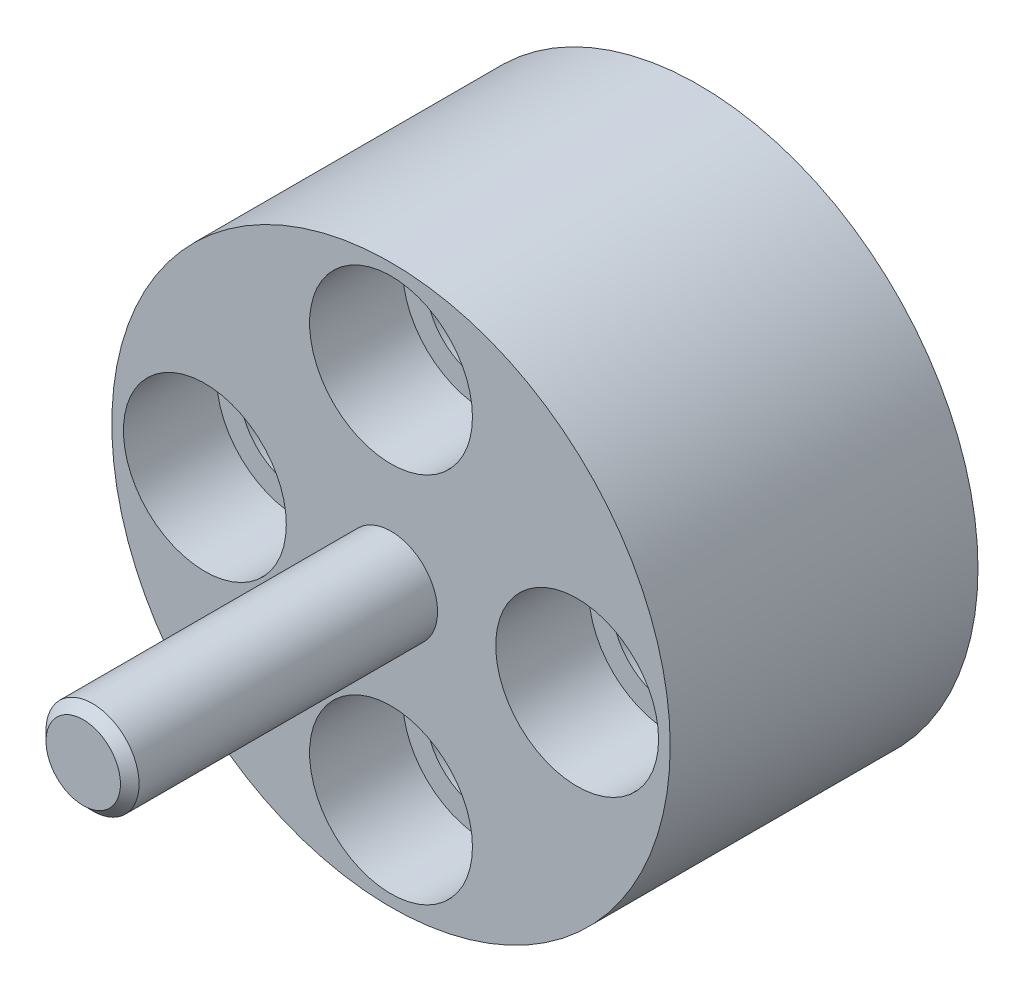
ISO-10303-21;
HEADER;
FILE_DESCRIPTION(('STEP AP214'),'2;1');
FILE_NAME('part.step','',(''),(''),'','','');
FILE_SCHEMA(('AUTOMOTIVE_DESIGN { 1 0 10303 214 1 1 1 1 }'));
ENDSEC;
DATA;
#1=APPLICATION_CONTEXT('core data for automotive mechanical design processes');
#2=APPLICATION_PROTOCOL_DEFINITION('international standard','automotive_design',2000,#1);
#3=PRODUCT_CONTEXT('',#1,'mechanical');
#4=PRODUCT('Part','Part','',(#3));
#5=PRODUCT_RELATED_PRODUCT_CATEGORY('part','',(#4));
#6=PRODUCT_DEFINITION_FORMATION('','',#4);
#7=PRODUCT_DEFINITION_CONTEXT('part definition',#1,'design');
#8=PRODUCT_DEFINITION('design','',#6,#7);
#9=PRODUCT_DEFINITION_SHAPE('','',#8);
#10=(LENGTH_UNIT() NAMED_UNIT(*) SI_UNIT(.MILLI.,.METRE.));
#11=(NAMED_UNIT(*) PLANE_ANGLE_UNIT() SI_UNIT($,.RADIAN.));
#12=(NAMED_UNIT(*) SI_UNIT($,.STERADIAN.) SOLID_ANGLE_UNIT());
#13=UNCERTAINTY_MEASURE_WITH_UNIT(LENGTH_MEASURE(1.E-05),#10,'distance_accuracy_value','');
#14=(GEOMETRIC_REPRESENTATION_CONTEXT(3) GLOBAL_UNCERTAINTY_ASSIGNED_CONTEXT((#13)) GLOBAL_UNIT_ASSIGNED_CONTEXT((#10,
#11,#12)) REPRESENTATION_CONTEXT('',''));
#15=CARTESIAN_POINT('',(0.,0.,0.));
#16=DIRECTION('',(0.,0.,1.));
#17=DIRECTION('',(1.,0.,0.));
#18=AXIS2_PLACEMENT_3D('',#15,#16,#17);
#19=CARTESIAN_POINT('',(0.,0.,0.));
#20=DIRECTION('',(0.,0.,1.));
#21=DIRECTION('',(1.,0.,0.));
#22=AXIS2_PLACEMENT_3D('',#19,#20,#21);
#23=PLANE('',#22);
#24=CARTESIAN_POINT('',(-12.7,0.,0.));
#25=DIRECTION('',(0.,0.,1.));
#26=DIRECTION('',(1.,0.,0.));
#27=AXIS2_PLACEMENT_3D('',#24,#25,#26);
#28=CIRCLE('',#27,3.96875);
#29=CARTESIAN_POINT('',(-8.73125,0.,0.));
#30=VERTEX_POINT('',#29);
#31=EDGE_CURVE('E86',#30,#30,#28,.T.);
#32=ORIENTED_EDGE('',*,*,#31,.T.);
#33=EDGE_LOOP('',(#32));
#34=FACE_BOUND('',#33,.T.);
#35=CARTESIAN_POINT('',(12.7,0.,0.));
#36=DIRECTION('',(0.,0.,1.));
#37=DIRECTION('',(1.,0.,0.));
#38=AXIS2_PLACEMENT_3D('',#35,#36,#37);
#39=CIRCLE('',#38,3.96875);
#40=CARTESIAN_POINT('',(16.66875,0.,0.));
#41=VERTEX_POINT('',#40);
#42=EDGE_CURVE('E92',#41,#41,#39,.T.);
#43=ORIENTED_EDGE('',*,*,#42,.T.);
#44=EDGE_LOOP('',(#43));
#45=FACE_BOUND('',#44,.T.);
#46=CARTESIAN_POINT('',(0.,0.,0.));
#47=DIRECTION('',(0.,0.,1.));
#48=DIRECTION('',(1.,0.,0.));
#49=AXIS2_PLACEMENT_3D('',#46,#47,#48);
#50=CIRCLE('',#49,19.05);
#51=CARTESIAN_POINT('',(19.05,0.,0.));
#52=VERTEX_POINT('',#51);
#53=EDGE_CURVE('E98',#52,#52,#50,.T.);
#54=ORIENTED_EDGE('',*,*,#53,.F.);
#55=EDGE_LOOP('',(#54));
#56=FACE_BOUND('',#55,.T.);
#57=CARTESIAN_POINT('',(0.,12.7,0.));
#58=DIRECTION('',(0.,0.,1.));
#59=DIRECTION('',(1.,0.,0.));
#60=AXIS2_PLACEMENT_3D('',#57,#58,#59);
#61=CIRCLE('',#60,3.96875);
#62=CARTESIAN_POINT('',(3.96875,12.7,0.));
#63=VERTEX_POINT('',#62);
#64=EDGE_CURVE('E95',#63,#63,#61,.T.);
#65=ORIENTED_EDGE('',*,*,#64,.T.);
#66=EDGE_LOOP('',(#65));
#67=FACE_BOUND('',#66,.T.);
#68=CARTESIAN_POINT('',(0.,-12.7,0.));
#69=DIRECTION('',(0.,0.,1.));
#70=DIRECTION('',(1.,0.,0.));
#71=AXIS2_PLACEMENT_3D('',#68,#69,#70);
#72=CIRCLE('',#71,3.96875);
#73=CARTESIAN_POINT('',(3.96875,-12.7,0.));
#74=VERTEX_POINT('',#73);
#75=EDGE_CURVE('E89',#74,#74,#72,.T.);
#76=ORIENTED_EDGE('',*,*,#75,.T.);
#77=EDGE_LOOP('',(#76));
#78=FACE_BOUND('',#77,.T.);
#79=CARTESIAN_POINT('',(0.,0.,0.));
#80=DIRECTION('',(0.,0.,-1.));
#81=DIRECTION('',(-1.,0.,0.));
#82=AXIS2_PLACEMENT_3D('',#79,#80,#81);
#83=CIRCLE('',#82,5.55625);
#84=CARTESIAN_POINT('',(-5.55625,0.,0.));
#85=VERTEX_POINT('',#84);
#86=EDGE_CURVE('E116',#85,#85,#83,.T.);
#87=ORIENTED_EDGE('',*,*,#86,.F.);
#88=EDGE_LOOP('',(#87));
#89=FACE_BOUND('',#88,.T.);
#90=ADVANCED_FACE('F35',(#34,#45,#56,#67,#78,#89),#23,.F.);
#91=CARTESIAN_POINT('',(0.,0.,21.));
#92=DIRECTION('',(0.,0.,1.));
#93=DIRECTION('',(1.,0.,0.));
#94=AXIS2_PLACEMENT_3D('',#91,#92,#93);
#95=PLANE('',#94);
#96=CARTESIAN_POINT('',(0.,12.7,21.));
#97=DIRECTION('',(0.,0.,1.));
#98=DIRECTION('',(1.,0.,0.));
#99=AXIS2_PLACEMENT_3D('',#96,#97,#98);
#100=CIRCLE('',#99,5.55625);
#101=CARTESIAN_POINT('',(5.55625,12.7,21.));
#102=VERTEX_POINT('',#101);
#103=EDGE_CURVE('E121',#102,#102,#100,.T.);
#104=ORIENTED_EDGE('',*,*,#103,.F.);
#105=EDGE_LOOP('',(#104));
#106=FACE_BOUND('',#105,.T.);
#107=CARTESIAN_POINT('',(12.7,0.,21.));
#108=DIRECTION('',(0.,0.,1.));
#109=DIRECTION('',(1.,0.,0.));
#110=AXIS2_PLACEMENT_3D('',#107,#108,#109);
#111=CIRCLE('',#110,5.55625);
#112=CARTESIAN_POINT('',(18.25625,0.,21.));
#113=VERTEX_POINT('',#112);
#114=EDGE_CURVE('E70',#113,#113,#111,.T.);
#115=ORIENTED_EDGE('',*,*,#114,.F.);
#116=EDGE_LOOP('',(#115));
#117=FACE_BOUND('',#116,.T.);
#118=CARTESIAN_POINT('',(0.,-12.7,21.));
#119=DIRECTION('',(0.,0.,1.));
#120=DIRECTION('',(1.,0.,0.));
#121=AXIS2_PLACEMENT_3D('',#118,#119,#120);
#122=CIRCLE('',#121,5.55625);
#123=CARTESIAN_POINT('',(5.55625,-12.7,21.));
#124=VERTEX_POINT('',#123);
#125=EDGE_CURVE('E63',#124,#124,#122,.T.);
#126=ORIENTED_EDGE('',*,*,#125,.F.);
#127=EDGE_LOOP('',(#126));
#128=FACE_BOUND('',#127,.T.);
#129=CARTESIAN_POINT('',(-12.7,0.,21.));
#130=DIRECTION('',(0.,0.,1.));
#131=DIRECTION('',(1.,0.,0.));
#132=AXIS2_PLACEMENT_3D('',#129,#130,#131);
#133=CIRCLE('',#132,5.55625);
#134=CARTESIAN_POINT('',(-7.14375,0.,21.));
#135=VERTEX_POINT('',#134);
#136=EDGE_CURVE('E59',#135,#135,#133,.T.);
#137=ORIENTED_EDGE('',*,*,#136,.F.);
#138=EDGE_LOOP('',(#137));
#139=FACE_BOUND('',#138,.T.);
#140=CARTESIAN_POINT('',(0.,0.,21.));
#141=DIRECTION('',(0.,0.,1.));
#142=DIRECTION('',(1.,0.,0.));
#143=AXIS2_PLACEMENT_3D('',#140,#141,#142);
#144=CIRCLE('',#143,19.05);
#145=CARTESIAN_POINT('',(19.05,0.,21.));
#146=VERTEX_POINT('',#145);
#147=EDGE_CURVE('E48',#146,#146,#144,.T.);
#148=ORIENTED_EDGE('',*,*,#147,.T.);
#149=EDGE_LOOP('',(#148));
#150=FACE_BOUND('',#149,.T.);
#151=CARTESIAN_POINT('',(0.,0.,21.));
#152=DIRECTION('',(0.,0.,1.));
#153=DIRECTION('',(1.,0.,0.));
#154=AXIS2_PLACEMENT_3D('',#151,#152,#153);
#155=CIRCLE('',#154,3.175);
#156=CARTESIAN_POINT('',(3.175,0.,21.));
#157=VERTEX_POINT('',#156);
#158=EDGE_CURVE('E55',#157,#157,#155,.T.);
#159=ORIENTED_EDGE('',*,*,#158,.F.);
#160=EDGE_LOOP('',(#159));
#161=FACE_BOUND('',#160,.T.);
#162=ADVANCED_FACE('F107',(#106,#117,#128,#139,#150,#161),#95,.T.);
#163=CARTESIAN_POINT('',(0.,0.,21.));
#164=DIRECTION('',(0.,0.,-1.));
#165=DIRECTION('',(-1.,0.,0.));
#166=AXIS2_PLACEMENT_3D('',#163,#164,#165);
#167=CYLINDRICAL_SURFACE('',#166,19.05);
#168=ORIENTED_EDGE('',*,*,#147,.F.);
#169=EDGE_LOOP('',(#168));
#170=FACE_BOUND('',#169,.T.);
#171=ORIENTED_EDGE('',*,*,#53,.T.);
#172=EDGE_LOOP('',(#171));
#173=FACE_BOUND('',#172,.T.);
#174=ADVANCED_FACE('F103',(#170,#173),#167,.T.);
#175=CARTESIAN_POINT('',(0.,12.7,21.));
#176=DIRECTION('',(0.,0.,-1.));
#177=DIRECTION('',(-1.,0.,0.));
#178=AXIS2_PLACEMENT_3D('',#175,#176,#177);
#179=CYLINDRICAL_SURFACE('',#178,3.96875);
#180=CARTESIAN_POINT('',(0.,12.7,14.65));
#181=DIRECTION('',(0.,0.,-1.));
#182=DIRECTION('',(-1.,0.,0.));
#183=AXIS2_PLACEMENT_3D('',#180,#181,#182);
#184=CIRCLE('',#183,3.96875);
#185=CARTESIAN_POINT('',(-3.96875,12.7,14.65));
#186=VERTEX_POINT('',#185);
#187=EDGE_CURVE('E39',#186,#186,#184,.T.);
#188=ORIENTED_EDGE('',*,*,#187,.F.);
#189=EDGE_LOOP('',(#188));
#190=FACE_BOUND('',#189,.T.);
#191=ORIENTED_EDGE('',*,*,#64,.F.);
#192=EDGE_LOOP('',(#191));
#193=FACE_BOUND('',#192,.T.);
#194=ADVANCED_FACE('F134',(#190,#193),#179,.F.);
#195=CARTESIAN_POINT('',(12.7,0.,21.));
#196=DIRECTION('',(0.,0.,-1.));
#197=DIRECTION('',(-1.,0.,0.));
#198=AXIS2_PLACEMENT_3D('',#195,#196,#197);
#199=CYLINDRICAL_SURFACE('',#198,3.96875);
#200=CARTESIAN_POINT('',(12.7,0.,14.65));
#201=DIRECTION('',(0.,0.,-1.));
#202=DIRECTION('',(-1.,0.,0.));
#203=AXIS2_PLACEMENT_3D('',#200,#201,#202);
#204=CIRCLE('',#203,3.96875);
#205=CARTESIAN_POINT('',(8.73125,0.,14.65));
#206=VERTEX_POINT('',#205);
#207=EDGE_CURVE('E61',#206,#206,#204,.T.);
#208=ORIENTED_EDGE('',*,*,#207,.F.);
#209=EDGE_LOOP('',(#208));
#210=FACE_BOUND('',#209,.T.);
#211=ORIENTED_EDGE('',*,*,#42,.F.);
#212=EDGE_LOOP('',(#211));
#213=FACE_BOUND('',#212,.T.);
#214=ADVANCED_FACE('F137',(#210,#213),#199,.F.);
#215=CARTESIAN_POINT('',(0.,-12.7,21.));
#216=DIRECTION('',(0.,0.,-1.));
#217=DIRECTION('',(-1.,0.,0.));
#218=AXIS2_PLACEMENT_3D('',#215,#216,#217);
#219=CYLINDRICAL_SURFACE('',#218,3.96875);
#220=CARTESIAN_POINT('',(0.,-12.7,14.65));
#221=DIRECTION('',(0.,0.,-1.));
#222=DIRECTION('',(-1.,0.,0.));
#223=AXIS2_PLACEMENT_3D('',#220,#221,#222);
#224=CIRCLE('',#223,3.96875);
#225=CARTESIAN_POINT('',(-3.96875,-12.7,14.65));
#226=VERTEX_POINT('',#225);
#227=EDGE_CURVE('E57',#226,#226,#224,.T.);
#228=ORIENTED_EDGE('',*,*,#227,.F.);
#229=EDGE_LOOP('',(#228));
#230=FACE_BOUND('',#229,.T.);
#231=ORIENTED_EDGE('',*,*,#75,.F.);
#232=EDGE_LOOP('',(#231));
#233=FACE_BOUND('',#232,.T.);
#234=ADVANCED_FACE('F143',(#230,#233),#219,.F.);
#235=CARTESIAN_POINT('',(-12.7,0.,21.));
#236=DIRECTION('',(0.,0.,-1.));
#237=DIRECTION('',(-1.,0.,0.));
#238=AXIS2_PLACEMENT_3D('',#235,#236,#237);
#239=CYLINDRICAL_SURFACE('',#238,3.96875);
#240=CARTESIAN_POINT('',(-12.7,0.,14.65));
#241=DIRECTION('',(0.,0.,-1.));
#242=DIRECTION('',(-1.,0.,0.));
#243=AXIS2_PLACEMENT_3D('',#240,#241,#242);
#244=CIRCLE('',#243,3.96875);
#245=CARTESIAN_POINT('',(-16.66875,0.,14.65));
#246=VERTEX_POINT('',#245);
#247=EDGE_CURVE('E52',#246,#246,#244,.T.);
#248=ORIENTED_EDGE('',*,*,#247,.F.);
#249=EDGE_LOOP('',(#248));
#250=FACE_BOUND('',#249,.T.);
#251=ORIENTED_EDGE('',*,*,#31,.F.);
#252=EDGE_LOOP('',(#251));
#253=FACE_BOUND('',#252,.T.);
#254=ADVANCED_FACE('F168',(#250,#253),#239,.F.);
#255=CARTESIAN_POINT('',(0.,0.,42.));
#256=DIRECTION('',(0.,0.,-1.));
#257=DIRECTION('',(-1.,0.,0.));
#258=AXIS2_PLACEMENT_3D('',#255,#256,#257);
#259=CYLINDRICAL_SURFACE('',#258,3.175);
#260=CARTESIAN_POINT('',(0.,0.,41.365));
#261=DIRECTION('',(0.,0.,1.));
#262=DIRECTION('',(1.,0.,0.));
#263=AXIS2_PLACEMENT_3D('',#260,#261,#262);
#264=CIRCLE('',#263,3.175);
#265=CARTESIAN_POINT('',(3.175,0.,41.365));
#266=VERTEX_POINT('',#265);
#267=EDGE_CURVE('E10',#266,#266,#264,.F.);
#268=ORIENTED_EDGE('',*,*,#267,.T.);
#269=EDGE_LOOP('',(#268));
#270=FACE_BOUND('',#269,.T.);
#271=ORIENTED_EDGE('',*,*,#158,.T.);
#272=EDGE_LOOP('',(#271));
#273=FACE_BOUND('',#272,.T.);
#274=ADVANCED_FACE('F165',(#270,#273),#259,.T.);
#275=CARTESIAN_POINT('',(0.,0.,42.));
#276=DIRECTION('',(0.,0.,1.));
#277=DIRECTION('',(1.,0.,0.));
#278=AXIS2_PLACEMENT_3D('',#275,#276,#277);
#279=PLANE('',#278);
#280=CARTESIAN_POINT('',(0.,0.,42.));
#281=DIRECTION('',(0.,0.,1.));
#282=DIRECTION('',(1.,0.,0.));
#283=AXIS2_PLACEMENT_3D('',#280,#281,#282);
#284=CIRCLE('',#283,2.54000000000003);
#285=CARTESIAN_POINT('',(2.54000000000003,0.,42.));
#286=VERTEX_POINT('',#285);
#287=EDGE_CURVE('E43',#286,#286,#284,.T.);
#288=ORIENTED_EDGE('',*,*,#287,.T.);
#289=EDGE_LOOP('',(#288));
#290=FACE_BOUND('',#289,.T.);
#291=ADVANCED_FACE('F167',(#290),#279,.T.);
#292=CARTESIAN_POINT('',(0.,0.,42.));
#293=DIRECTION('',(0.,0.,-1.));
#294=DIRECTION('',(-1.,0.,0.));
#295=AXIS2_PLACEMENT_3D('',#292,#293,#294);
#296=CONICAL_SURFACE('',#295,2.54000000000003,0.785398163397451);
#297=ORIENTED_EDGE('',*,*,#267,.F.);
#298=EDGE_LOOP('',(#297));
#299=FACE_BOUND('',#298,.T.);
#300=ORIENTED_EDGE('',*,*,#287,.F.);
#301=EDGE_LOOP('',(#300));
#302=FACE_BOUND('',#301,.T.);
#303=ADVANCED_FACE('F37',(#299,#302),#296,.T.);
#304=CARTESIAN_POINT('',(-9.3218,0.,14.65));
#305=DIRECTION('',(0.,0.,-1.));
#306=DIRECTION('',(-1.,0.,0.));
#307=AXIS2_PLACEMENT_3D('',#304,#305,#306);
#308=PLANE('',#307);
#309=ORIENTED_EDGE('',*,*,#247,.T.);
#310=EDGE_LOOP('',(#309));
#311=FACE_BOUND('',#310,.T.);
#312=CARTESIAN_POINT('',(-12.7,0.,14.65));
#313=DIRECTION('',(0.,0.,1.));
#314=DIRECTION('',(1.,0.,0.));
#315=AXIS2_PLACEMENT_3D('',#312,#313,#314);
#316=CIRCLE('',#315,5.55625);
#317=CARTESIAN_POINT('',(-7.14375,0.,14.65));
#318=VERTEX_POINT('',#317);
#319=EDGE_CURVE('E56',#318,#318,#316,.T.);
#320=ORIENTED_EDGE('',*,*,#319,.T.);
#321=EDGE_LOOP('',(#320));
#322=FACE_BOUND('',#321,.T.);
#323=ADVANCED_FACE('F211',(#311,#322),#308,.F.);
#324=CARTESIAN_POINT('',(-12.7,0.,21.));
#325=DIRECTION('',(0.,0.,1.));
#326=DIRECTION('',(1.,0.,0.));
#327=AXIS2_PLACEMENT_3D('',#324,#325,#326);
#328=CYLINDRICAL_SURFACE('',#327,5.55625);
#329=ORIENTED_EDGE('',*,*,#319,.F.);
#330=EDGE_LOOP('',(#329));
#331=FACE_BOUND('',#330,.T.);
#332=ORIENTED_EDGE('',*,*,#136,.T.);
#333=EDGE_LOOP('',(#332));
#334=FACE_BOUND('',#333,.T.);
#335=ADVANCED_FACE('F195',(#331,#334),#328,.F.);
#336=CARTESIAN_POINT('',(3.3782,-12.7,14.65));
#337=DIRECTION('',(0.,0.,-1.));
#338=DIRECTION('',(-1.,0.,0.));
#339=AXIS2_PLACEMENT_3D('',#336,#337,#338);
#340=PLANE('',#339);
#341=ORIENTED_EDGE('',*,*,#227,.T.);
#342=EDGE_LOOP('',(#341));
#343=FACE_BOUND('',#342,.T.);
#344=CARTESIAN_POINT('',(0.,-12.7,14.65));
#345=DIRECTION('',(0.,0.,1.));
#346=DIRECTION('',(1.,0.,0.));
#347=AXIS2_PLACEMENT_3D('',#344,#345,#346);
#348=CIRCLE('',#347,5.55625);
#349=CARTESIAN_POINT('',(5.55625,-12.7,14.65));
#350=VERTEX_POINT('',#349);
#351=EDGE_CURVE('E60',#350,#350,#348,.T.);
#352=ORIENTED_EDGE('',*,*,#351,.T.);
#353=EDGE_LOOP('',(#352));
#354=FACE_BOUND('',#353,.T.);
#355=ADVANCED_FACE('F191',(#343,#354),#340,.F.);
#356=CARTESIAN_POINT('',(0.,-12.7,21.));
#357=DIRECTION('',(0.,0.,1.));
#358=DIRECTION('',(1.,0.,0.));
#359=AXIS2_PLACEMENT_3D('',#356,#357,#358);
#360=CYLINDRICAL_SURFACE('',#359,5.55625);
#361=ORIENTED_EDGE('',*,*,#351,.F.);
#362=EDGE_LOOP('',(#361));
#363=FACE_BOUND('',#362,.T.);
#364=ORIENTED_EDGE('',*,*,#125,.T.);
#365=EDGE_LOOP('',(#364));
#366=FACE_BOUND('',#365,.T.);
#367=ADVANCED_FACE('F194',(#363,#366),#360,.F.);
#368=CARTESIAN_POINT('',(16.0782,0.,14.65));
#369=DIRECTION('',(0.,0.,-1.));
#370=DIRECTION('',(-1.,0.,0.));
#371=AXIS2_PLACEMENT_3D('',#368,#369,#370);
#372=PLANE('',#371);
#373=ORIENTED_EDGE('',*,*,#207,.T.);
#374=EDGE_LOOP('',(#373));
#375=FACE_BOUND('',#374,.T.);
#376=CARTESIAN_POINT('',(12.7,0.,14.65));
#377=DIRECTION('',(0.,0.,1.));
#378=DIRECTION('',(1.,0.,0.));
#379=AXIS2_PLACEMENT_3D('',#376,#377,#378);
#380=CIRCLE('',#379,5.55625);
#381=CARTESIAN_POINT('',(18.25625,0.,14.65));
#382=VERTEX_POINT('',#381);
#383=EDGE_CURVE('E64',#382,#382,#380,.T.);
#384=ORIENTED_EDGE('',*,*,#383,.T.);
#385=EDGE_LOOP('',(#384));
#386=FACE_BOUND('',#385,.T.);
#387=ADVANCED_FACE('F201',(#375,#386),#372,.F.);
#388=CARTESIAN_POINT('',(12.7,0.,21.));
#389=DIRECTION('',(0.,0.,1.));
#390=DIRECTION('',(1.,0.,0.));
#391=AXIS2_PLACEMENT_3D('',#388,#389,#390);
#392=CYLINDRICAL_SURFACE('',#391,5.55625);
#393=ORIENTED_EDGE('',*,*,#383,.F.);
#394=EDGE_LOOP('',(#393));
#395=FACE_BOUND('',#394,.T.);
#396=ORIENTED_EDGE('',*,*,#114,.T.);
#397=EDGE_LOOP('',(#396));
#398=FACE_BOUND('',#397,.T.);
#399=ADVANCED_FACE('F206',(#395,#398),#392,.F.);
#400=CARTESIAN_POINT('',(3.3782,12.7,14.65));
#401=DIRECTION('',(0.,0.,-1.));
#402=DIRECTION('',(-1.,0.,0.));
#403=AXIS2_PLACEMENT_3D('',#400,#401,#402);
#404=PLANE('',#403);
#405=ORIENTED_EDGE('',*,*,#187,.T.);
#406=EDGE_LOOP('',(#405));
#407=FACE_BOUND('',#406,.T.);
#408=CARTESIAN_POINT('',(0.,12.7,14.65));
#409=DIRECTION('',(0.,0.,1.));
#410=DIRECTION('',(1.,0.,0.));
#411=AXIS2_PLACEMENT_3D('',#408,#409,#410);
#412=CIRCLE('',#411,5.55625);
#413=CARTESIAN_POINT('',(5.55625,12.7,14.65));
#414=VERTEX_POINT('',#413);
#415=EDGE_CURVE('E125',#414,#414,#412,.T.);
#416=ORIENTED_EDGE('',*,*,#415,.T.);
#417=EDGE_LOOP('',(#416));
#418=FACE_BOUND('',#417,.T.);
#419=ADVANCED_FACE('F132',(#407,#418),#404,.F.);
#420=CARTESIAN_POINT('',(0.,12.7,21.));
#421=DIRECTION('',(0.,0.,1.));
#422=DIRECTION('',(1.,0.,0.));
#423=AXIS2_PLACEMENT_3D('',#420,#421,#422);
#424=CYLINDRICAL_SURFACE('',#423,5.55625);
#425=ORIENTED_EDGE('',*,*,#415,.F.);
#426=EDGE_LOOP('',(#425));
#427=FACE_BOUND('',#426,.T.);
#428=ORIENTED_EDGE('',*,*,#103,.T.);
#429=EDGE_LOOP('',(#428));
#430=FACE_BOUND('',#429,.T.);
#431=ADVANCED_FACE('F289',(#427,#430),#424,.F.);
#432=CARTESIAN_POINT('',(0.,0.,0.));
#433=DIRECTION('',(0.,0.,-1.));
#434=DIRECTION('',(-1.,0.,0.));
#435=AXIS2_PLACEMENT_3D('',#432,#433,#434);
#436=CYLINDRICAL_SURFACE('',#435,5.55625);
#437=CARTESIAN_POINT('',(0.,0.,6.858));
#438=DIRECTION('',(0.,0.,-1.));
#439=DIRECTION('',(-1.,0.,0.));
#440=AXIS2_PLACEMENT_3D('',#437,#438,#439);
#441=CIRCLE('',#440,5.55625);
#442=CARTESIAN_POINT('',(-5.55625,0.,6.858));
#443=VERTEX_POINT('',#442);
#444=EDGE_CURVE('E118',#443,#443,#441,.T.);
#445=ORIENTED_EDGE('',*,*,#444,.F.);
#446=EDGE_LOOP('',(#445));
#447=FACE_BOUND('',#446,.T.);
#448=ORIENTED_EDGE('',*,*,#86,.T.);
#449=EDGE_LOOP('',(#448));
#450=FACE_BOUND('',#449,.T.);
#451=ADVANCED_FACE('F182',(#447,#450),#436,.F.);
#452=CARTESIAN_POINT('',(0.,0.,6.858));
#453=DIRECTION('',(0.,0.,-1.));
#454=DIRECTION('',(-1.,0.,0.));
#455=AXIS2_PLACEMENT_3D('',#452,#453,#454);
#456=PLANE('',#455);
#457=ORIENTED_EDGE('',*,*,#444,.T.);
#458=EDGE_LOOP('',(#457));
#459=FACE_BOUND('',#458,.T.);
#460=ADVANCED_FACE('F180',(#459),#456,.T.);
#461=CLOSED_SHELL('',(#90,#162,#174,#194,#214,#234,#254,#274,#291,#303,#323,#335,#355,#367,#387,
#399,#419,#431,#451,#460));
#462=MANIFOLD_SOLID_BREP('B2',#461);
#463=ADVANCED_BREP_SHAPE_REPRESENTATION('',(#18,#462),#14);
#464=SHAPE_DEFINITION_REPRESENTATION(#9,#463);
ENDSEC;
END-ISO-10303-21;
